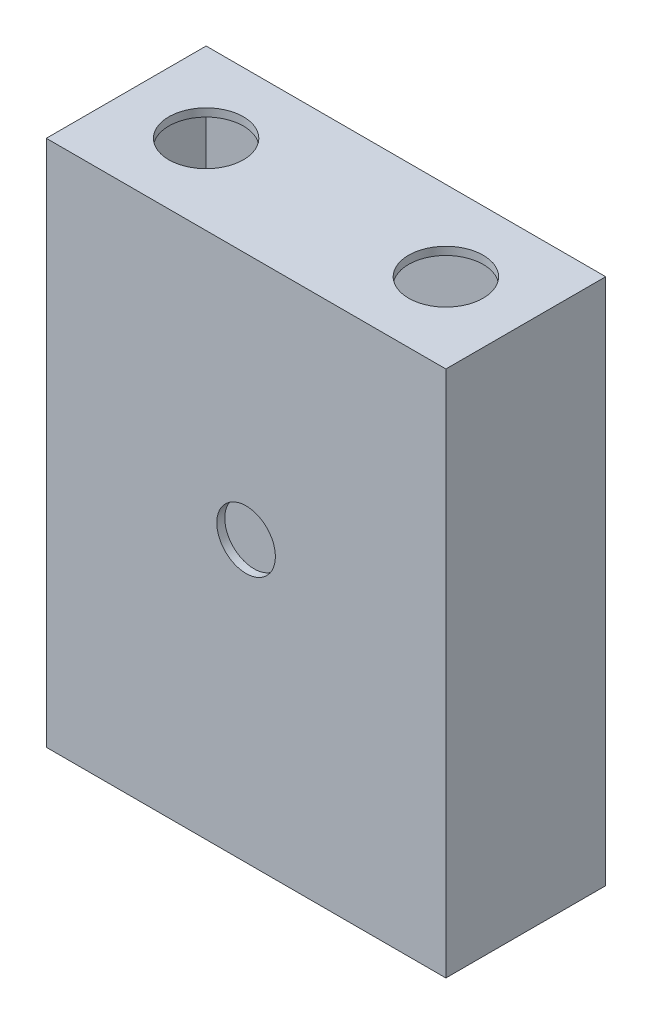
ISO-10303-21;
HEADER;
FILE_DESCRIPTION(('STEP AP214'),'2;1');
FILE_NAME('part.step','',(''),(''),'','','');
FILE_SCHEMA(('AUTOMOTIVE_DESIGN { 1 0 10303 214 1 1 1 1 }'));
ENDSEC;
DATA;
#1=APPLICATION_CONTEXT('core data for automotive mechanical design processes');
#2=APPLICATION_PROTOCOL_DEFINITION('international standard','automotive_design',2000,#1);
#3=PRODUCT_CONTEXT('',#1,'mechanical');
#4=PRODUCT('Part','Part','',(#3));
#5=PRODUCT_RELATED_PRODUCT_CATEGORY('part','',(#4));
#6=PRODUCT_DEFINITION_FORMATION('','',#4);
#7=PRODUCT_DEFINITION_CONTEXT('part definition',#1,'design');
#8=PRODUCT_DEFINITION('design','',#6,#7);
#9=PRODUCT_DEFINITION_SHAPE('','',#8);
#10=(LENGTH_UNIT() NAMED_UNIT(*) SI_UNIT(.MILLI.,.METRE.));
#11=(NAMED_UNIT(*) PLANE_ANGLE_UNIT() SI_UNIT($,.RADIAN.));
#12=(NAMED_UNIT(*) SI_UNIT($,.STERADIAN.) SOLID_ANGLE_UNIT());
#13=UNCERTAINTY_MEASURE_WITH_UNIT(LENGTH_MEASURE(1.E-05),#10,'distance_accuracy_value','');
#14=(GEOMETRIC_REPRESENTATION_CONTEXT(3) GLOBAL_UNCERTAINTY_ASSIGNED_CONTEXT((#13)) GLOBAL_UNIT_ASSIGNED_CONTEXT((#10,
#11,#12)) REPRESENTATION_CONTEXT('',''));
#15=CARTESIAN_POINT('',(0.,0.,0.));
#16=DIRECTION('',(0.,0.,1.));
#17=DIRECTION('',(1.,0.,0.));
#18=AXIS2_PLACEMENT_3D('',#15,#16,#17);
#19=CARTESIAN_POINT('',(0.,3.,0.));
#20=DIRECTION('',(0.,-1.,0.));
#21=DIRECTION('',(0.,0.,-1.));
#22=AXIS2_PLACEMENT_3D('',#19,#20,#21);
#23=PLANE('',#22);
#24=DIRECTION('',(1.,0.,0.));
#25=VECTOR('',#24,1.);
#26=CARTESIAN_POINT('',(-120.,3.,30.));
#27=LINE('',#26,#25);
#28=CARTESIAN_POINT('',(-120.,3.,30.));
#29=VERTEX_POINT('',#28);
#30=CARTESIAN_POINT('',(30.,3.,30.));
#31=VERTEX_POINT('',#30);
#32=EDGE_CURVE('E167',#29,#31,#27,.T.);
#33=ORIENTED_EDGE('',*,*,#32,.T.);
#34=DIRECTION('',(0.,0.,1.));
#35=VECTOR('',#34,1.);
#36=CARTESIAN_POINT('',(30.,3.,-30.));
#37=LINE('',#36,#35);
#38=CARTESIAN_POINT('',(30.,3.,-30.));
#39=VERTEX_POINT('',#38);
#40=EDGE_CURVE('E147',#39,#31,#37,.T.);
#41=ORIENTED_EDGE('',*,*,#40,.F.);
#42=DIRECTION('',(-1.,0.,0.));
#43=VECTOR('',#42,1.);
#44=CARTESIAN_POINT('',(-120.,3.,-30.));
#45=LINE('',#44,#43);
#46=CARTESIAN_POINT('',(-120.,3.,-30.));
#47=VERTEX_POINT('',#46);
#48=EDGE_CURVE('E161',#39,#47,#45,.T.);
#49=ORIENTED_EDGE('',*,*,#48,.T.);
#50=DIRECTION('',(0.,0.,1.));
#51=VECTOR('',#50,1.);
#52=CARTESIAN_POINT('',(-120.,3.,30.));
#53=LINE('',#52,#51);
#54=EDGE_CURVE('E165',#47,#29,#53,.T.);
#55=ORIENTED_EDGE('',*,*,#54,.T.);
#56=EDGE_LOOP('',(#33,#41,#49,#55));
#57=FACE_BOUND('',#56,.T.);
#58=CARTESIAN_POINT('',(0.,3.,0.));
#59=DIRECTION('',(0.,1.,0.));
#60=DIRECTION('',(0.,0.,1.));
#61=AXIS2_PLACEMENT_3D('',#58,#59,#60);
#62=CIRCLE('',#61,14.);
#63=CARTESIAN_POINT('',(0.,3.,14.));
#64=VERTEX_POINT('',#63);
#65=EDGE_CURVE('E158',#64,#64,#62,.T.);
#66=ORIENTED_EDGE('',*,*,#65,.F.);
#67=EDGE_LOOP('',(#66));
#68=FACE_BOUND('',#67,.T.);
#69=CARTESIAN_POINT('',(-90.,3.,0.));
#70=DIRECTION('',(0.,1.,0.));
#71=DIRECTION('',(0.,0.,1.));
#72=AXIS2_PLACEMENT_3D('',#69,#70,#71);
#73=CIRCLE('',#72,14.);
#74=CARTESIAN_POINT('',(-90.,3.,14.));
#75=VERTEX_POINT('',#74);
#76=EDGE_CURVE('E152',#75,#75,#73,.T.);
#77=ORIENTED_EDGE('',*,*,#76,.F.);
#78=EDGE_LOOP('',(#77));
#79=FACE_BOUND('',#78,.T.);
#80=ADVANCED_FACE('F33',(#57,#68,#79),#23,.F.);
#81=CARTESIAN_POINT('',(0.,0.,0.));
#82=DIRECTION('',(0.,-1.,0.));
#83=DIRECTION('',(0.,0.,-1.));
#84=AXIS2_PLACEMENT_3D('',#81,#82,#83);
#85=PLANE('',#84);
#86=DIRECTION('',(1.,0.,0.));
#87=VECTOR('',#86,1.);
#88=CARTESIAN_POINT('',(-117.,0.,-27.));
#89=LINE('',#88,#87);
#90=CARTESIAN_POINT('',(-117.,0.,-27.));
#91=VERTEX_POINT('',#90);
#92=CARTESIAN_POINT('',(27.,0.,-27.));
#93=VERTEX_POINT('',#92);
#94=EDGE_CURVE('E49',#91,#93,#89,.T.);
#95=ORIENTED_EDGE('',*,*,#94,.T.);
#96=DIRECTION('',(0.,0.,1.));
#97=VECTOR('',#96,1.);
#98=CARTESIAN_POINT('',(27.,0.,-27.));
#99=LINE('',#98,#97);
#100=CARTESIAN_POINT('',(27.,0.,27.));
#101=VERTEX_POINT('',#100);
#102=EDGE_CURVE('E53',#93,#101,#99,.T.);
#103=ORIENTED_EDGE('',*,*,#102,.T.);
#104=DIRECTION('',(-1.,0.,0.));
#105=VECTOR('',#104,1.);
#106=CARTESIAN_POINT('',(-117.,0.,27.));
#107=LINE('',#106,#105);
#108=CARTESIAN_POINT('',(-117.,0.,27.));
#109=VERTEX_POINT('',#108);
#110=EDGE_CURVE('E128',#101,#109,#107,.T.);
#111=ORIENTED_EDGE('',*,*,#110,.T.);
#112=DIRECTION('',(0.,0.,-1.));
#113=VECTOR('',#112,1.);
#114=CARTESIAN_POINT('',(-117.,0.,-27.));
#115=LINE('',#114,#113);
#116=EDGE_CURVE('E108',#109,#91,#115,.T.);
#117=ORIENTED_EDGE('',*,*,#116,.T.);
#118=EDGE_LOOP('',(#95,#103,#111,#117));
#119=FACE_BOUND('',#118,.T.);
#120=CARTESIAN_POINT('',(0.,0.,0.));
#121=DIRECTION('',(0.,1.,0.));
#122=DIRECTION('',(0.,0.,1.));
#123=AXIS2_PLACEMENT_3D('',#120,#121,#122);
#124=CIRCLE('',#123,14.);
#125=CARTESIAN_POINT('',(0.,0.,14.));
#126=VERTEX_POINT('',#125);
#127=EDGE_CURVE('E155',#126,#126,#124,.T.);
#128=ORIENTED_EDGE('',*,*,#127,.T.);
#129=EDGE_LOOP('',(#128));
#130=FACE_BOUND('',#129,.T.);
#131=CARTESIAN_POINT('',(-90.,0.,0.));
#132=DIRECTION('',(0.,1.,0.));
#133=DIRECTION('',(0.,0.,1.));
#134=AXIS2_PLACEMENT_3D('',#131,#132,#133);
#135=CIRCLE('',#134,14.);
#136=CARTESIAN_POINT('',(-90.,0.,14.));
#137=VERTEX_POINT('',#136);
#138=EDGE_CURVE('E151',#137,#137,#135,.T.);
#139=ORIENTED_EDGE('',*,*,#138,.T.);
#140=EDGE_LOOP('',(#139));
#141=FACE_BOUND('',#140,.T.);
#142=ADVANCED_FACE('F204',(#119,#130,#141),#85,.T.);
#143=CARTESIAN_POINT('',(-120.,3.,-30.));
#144=DIRECTION('',(0.,0.,1.));
#145=DIRECTION('',(1.,0.,0.));
#146=AXIS2_PLACEMENT_3D('',#143,#144,#145);
#147=PLANE('',#146);
#148=ORIENTED_EDGE('',*,*,#48,.F.);
#149=DIRECTION('',(0.,1.,0.));
#150=VECTOR('',#149,1.);
#151=CARTESIAN_POINT('',(30.,-2.,-30.));
#152=LINE('',#151,#150);
#153=CARTESIAN_POINT('',(30.,-195.,-30.));
#154=VERTEX_POINT('',#153);
#155=EDGE_CURVE('E149',#154,#39,#152,.T.);
#156=ORIENTED_EDGE('',*,*,#155,.F.);
#157=DIRECTION('',(1.,0.,0.));
#158=VECTOR('',#157,1.);
#159=CARTESIAN_POINT('',(-120.,-195.,-30.));
#160=LINE('',#159,#158);
#161=CARTESIAN_POINT('',(-120.,-195.,-30.));
#162=VERTEX_POINT('',#161);
#163=EDGE_CURVE('E138',#162,#154,#160,.T.);
#164=ORIENTED_EDGE('',*,*,#163,.F.);
#165=DIRECTION('',(0.,-1.,0.));
#166=VECTOR('',#165,1.);
#167=CARTESIAN_POINT('',(-120.,3.,-30.));
#168=LINE('',#167,#166);
#169=EDGE_CURVE('E42',#47,#162,#168,.T.);
#170=ORIENTED_EDGE('',*,*,#169,.F.);
#171=EDGE_LOOP('',(#148,#156,#164,#170));
#172=FACE_BOUND('',#171,.T.);
#173=ADVANCED_FACE('F35',(#172),#147,.F.);
#174=CARTESIAN_POINT('',(-120.,3.,30.));
#175=DIRECTION('',(1.,0.,0.));
#176=DIRECTION('',(0.,0.,-1.));
#177=AXIS2_PLACEMENT_3D('',#174,#175,#176);
#178=PLANE('',#177);
#179=ORIENTED_EDGE('',*,*,#169,.T.);
#180=DIRECTION('',(0.,0.,-1.));
#181=VECTOR('',#180,1.);
#182=CARTESIAN_POINT('',(-120.,-195.,-30.));
#183=LINE('',#182,#181);
#184=CARTESIAN_POINT('',(-120.,-195.,30.));
#185=VERTEX_POINT('',#184);
#186=EDGE_CURVE('E113',#185,#162,#183,.T.);
#187=ORIENTED_EDGE('',*,*,#186,.F.);
#188=DIRECTION('',(0.,-1.,0.));
#189=VECTOR('',#188,1.);
#190=CARTESIAN_POINT('',(-120.,3.,30.));
#191=LINE('',#190,#189);
#192=EDGE_CURVE('E170',#29,#185,#191,.T.);
#193=ORIENTED_EDGE('',*,*,#192,.F.);
#194=ORIENTED_EDGE('',*,*,#54,.F.);
#195=EDGE_LOOP('',(#179,#187,#193,#194));
#196=FACE_BOUND('',#195,.T.);
#197=ADVANCED_FACE('F177',(#196),#178,.F.);
#198=CARTESIAN_POINT('',(-120.,3.,30.));
#199=DIRECTION('',(0.,0.,-1.));
#200=DIRECTION('',(-1.,0.,0.));
#201=AXIS2_PLACEMENT_3D('',#198,#199,#200);
#202=PLANE('',#201);
#203=CARTESIAN_POINT('',(-45.,-90.,30.));
#204=DIRECTION('',(0.,0.,1.));
#205=DIRECTION('',(1.,0.,0.));
#206=AXIS2_PLACEMENT_3D('',#203,#204,#205);
#207=CIRCLE('',#206,11.);
#208=CARTESIAN_POINT('',(-34.,-90.,30.));
#209=VERTEX_POINT('',#208);
#210=EDGE_CURVE('E340',#209,#209,#207,.T.);
#211=ORIENTED_EDGE('',*,*,#210,.F.);
#212=EDGE_LOOP('',(#211));
#213=FACE_BOUND('',#212,.T.);
#214=ORIENTED_EDGE('',*,*,#192,.T.);
#215=DIRECTION('',(-1.,0.,0.));
#216=VECTOR('',#215,1.);
#217=CARTESIAN_POINT('',(-120.,-195.,30.));
#218=LINE('',#217,#216);
#219=CARTESIAN_POINT('',(30.,-195.,30.));
#220=VERTEX_POINT('',#219);
#221=EDGE_CURVE('E144',#220,#185,#218,.T.);
#222=ORIENTED_EDGE('',*,*,#221,.F.);
#223=DIRECTION('',(0.,1.,0.));
#224=VECTOR('',#223,1.);
#225=CARTESIAN_POINT('',(30.,3.,30.));
#226=LINE('',#225,#224);
#227=EDGE_CURVE('E11',#220,#31,#226,.T.);
#228=ORIENTED_EDGE('',*,*,#227,.T.);
#229=ORIENTED_EDGE('',*,*,#32,.F.);
#230=EDGE_LOOP('',(#214,#222,#228,#229));
#231=FACE_BOUND('',#230,.T.);
#232=ADVANCED_FACE('F185',(#213,#231),#202,.F.);
#233=CARTESIAN_POINT('',(0.,3.,0.));
#234=DIRECTION('',(0.,-1.,0.));
#235=DIRECTION('',(0.,0.,-1.));
#236=AXIS2_PLACEMENT_3D('',#233,#234,#235);
#237=CYLINDRICAL_SURFACE('',#236,14.);
#238=ORIENTED_EDGE('',*,*,#65,.T.);
#239=EDGE_LOOP('',(#238));
#240=FACE_BOUND('',#239,.T.);
#241=ORIENTED_EDGE('',*,*,#127,.F.);
#242=EDGE_LOOP('',(#241));
#243=FACE_BOUND('',#242,.T.);
#244=ADVANCED_FACE('F200',(#240,#243),#237,.F.);
#245=CARTESIAN_POINT('',(-90.,3.,0.));
#246=DIRECTION('',(0.,-1.,0.));
#247=DIRECTION('',(0.,0.,-1.));
#248=AXIS2_PLACEMENT_3D('',#245,#246,#247);
#249=CYLINDRICAL_SURFACE('',#248,14.);
#250=ORIENTED_EDGE('',*,*,#76,.T.);
#251=EDGE_LOOP('',(#250));
#252=FACE_BOUND('',#251,.T.);
#253=ORIENTED_EDGE('',*,*,#138,.F.);
#254=EDGE_LOOP('',(#253));
#255=FACE_BOUND('',#254,.T.);
#256=ADVANCED_FACE('F193',(#252,#255),#249,.F.);
#257=CARTESIAN_POINT('',(30.,-2.,-30.));
#258=DIRECTION('',(-1.,0.,0.));
#259=DIRECTION('',(0.,0.,1.));
#260=AXIS2_PLACEMENT_3D('',#257,#258,#259);
#261=PLANE('',#260);
#262=ORIENTED_EDGE('',*,*,#227,.F.);
#263=DIRECTION('',(0.,0.,1.));
#264=VECTOR('',#263,1.);
#265=CARTESIAN_POINT('',(30.,-195.,-30.));
#266=LINE('',#265,#264);
#267=EDGE_CURVE('E141',#154,#220,#266,.T.);
#268=ORIENTED_EDGE('',*,*,#267,.F.);
#269=ORIENTED_EDGE('',*,*,#155,.T.);
#270=ORIENTED_EDGE('',*,*,#40,.T.);
#271=EDGE_LOOP('',(#262,#268,#269,#270));
#272=FACE_BOUND('',#271,.T.);
#273=ADVANCED_FACE('F191',(#272),#261,.F.);
#274=CARTESIAN_POINT('',(0.,-195.,0.));
#275=DIRECTION('',(0.,1.,0.));
#276=DIRECTION('',(0.,0.,1.));
#277=AXIS2_PLACEMENT_3D('',#274,#275,#276);
#278=PLANE('',#277);
#279=ORIENTED_EDGE('',*,*,#186,.T.);
#280=ORIENTED_EDGE('',*,*,#163,.T.);
#281=ORIENTED_EDGE('',*,*,#267,.T.);
#282=ORIENTED_EDGE('',*,*,#221,.T.);
#283=EDGE_LOOP('',(#279,#280,#281,#282));
#284=FACE_BOUND('',#283,.T.);
#285=DIRECTION('',(1.,0.,0.));
#286=VECTOR('',#285,1.);
#287=CARTESIAN_POINT('',(-117.,-195.,-27.));
#288=LINE('',#287,#286);
#289=CARTESIAN_POINT('',(-117.,-195.,-27.));
#290=VERTEX_POINT('',#289);
#291=CARTESIAN_POINT('',(27.,-195.,-27.));
#292=VERTEX_POINT('',#291);
#293=EDGE_CURVE('E98',#290,#292,#288,.T.);
#294=ORIENTED_EDGE('',*,*,#293,.F.);
#295=DIRECTION('',(0.,0.,-1.));
#296=VECTOR('',#295,1.);
#297=CARTESIAN_POINT('',(-117.,-195.,-27.));
#298=LINE('',#297,#296);
#299=CARTESIAN_POINT('',(-117.,-195.,27.));
#300=VERTEX_POINT('',#299);
#301=EDGE_CURVE('E121',#300,#290,#298,.T.);
#302=ORIENTED_EDGE('',*,*,#301,.F.);
#303=DIRECTION('',(-1.,0.,0.));
#304=VECTOR('',#303,1.);
#305=CARTESIAN_POINT('',(-117.,-195.,27.));
#306=LINE('',#305,#304);
#307=CARTESIAN_POINT('',(27.,-195.,27.));
#308=VERTEX_POINT('',#307);
#309=EDGE_CURVE('E119',#308,#300,#306,.T.);
#310=ORIENTED_EDGE('',*,*,#309,.F.);
#311=DIRECTION('',(0.,0.,1.));
#312=VECTOR('',#311,1.);
#313=CARTESIAN_POINT('',(27.,-195.,-27.));
#314=LINE('',#313,#312);
#315=EDGE_CURVE('E107',#292,#308,#314,.T.);
#316=ORIENTED_EDGE('',*,*,#315,.F.);
#317=EDGE_LOOP('',(#294,#302,#310,#316));
#318=FACE_BOUND('',#317,.T.);
#319=ADVANCED_FACE('F117',(#284,#318),#278,.F.);
#320=CARTESIAN_POINT('',(-117.,-195.,-27.));
#321=DIRECTION('',(0.,0.,1.));
#322=DIRECTION('',(1.,0.,0.));
#323=AXIS2_PLACEMENT_3D('',#320,#321,#322);
#324=PLANE('',#323);
#325=ORIENTED_EDGE('',*,*,#94,.F.);
#326=DIRECTION('',(0.,1.,0.));
#327=VECTOR('',#326,1.);
#328=CARTESIAN_POINT('',(-117.,-195.,-27.));
#329=LINE('',#328,#327);
#330=EDGE_CURVE('E103',#290,#91,#329,.T.);
#331=ORIENTED_EDGE('',*,*,#330,.F.);
#332=ORIENTED_EDGE('',*,*,#293,.T.);
#333=DIRECTION('',(0.,1.,0.));
#334=VECTOR('',#333,1.);
#335=CARTESIAN_POINT('',(27.,-195.,-27.));
#336=LINE('',#335,#334);
#337=EDGE_CURVE('E101',#292,#93,#336,.T.);
#338=ORIENTED_EDGE('',*,*,#337,.T.);
#339=EDGE_LOOP('',(#325,#331,#332,#338));
#340=FACE_BOUND('',#339,.T.);
#341=ADVANCED_FACE('F100',(#340),#324,.T.);
#342=CARTESIAN_POINT('',(27.,-195.,-27.));
#343=DIRECTION('',(-1.,0.,0.));
#344=DIRECTION('',(0.,0.,1.));
#345=AXIS2_PLACEMENT_3D('',#342,#343,#344);
#346=PLANE('',#345);
#347=ORIENTED_EDGE('',*,*,#102,.F.);
#348=ORIENTED_EDGE('',*,*,#337,.F.);
#349=ORIENTED_EDGE('',*,*,#315,.T.);
#350=DIRECTION('',(0.,1.,0.));
#351=VECTOR('',#350,1.);
#352=CARTESIAN_POINT('',(27.,-195.,27.));
#353=LINE('',#352,#351);
#354=EDGE_CURVE('E114',#308,#101,#353,.T.);
#355=ORIENTED_EDGE('',*,*,#354,.T.);
#356=EDGE_LOOP('',(#347,#348,#349,#355));
#357=FACE_BOUND('',#356,.T.);
#358=ADVANCED_FACE('F111',(#357),#346,.T.);
#359=CARTESIAN_POINT('',(-117.,-195.,27.));
#360=DIRECTION('',(0.,0.,-1.));
#361=DIRECTION('',(-1.,0.,0.));
#362=AXIS2_PLACEMENT_3D('',#359,#360,#361);
#363=PLANE('',#362);
#364=CARTESIAN_POINT('',(-45.,-90.,27.));
#365=DIRECTION('',(0.,0.,-1.));
#366=DIRECTION('',(-1.,0.,0.));
#367=AXIS2_PLACEMENT_3D('',#364,#365,#366);
#368=CIRCLE('',#367,11.);
#369=CARTESIAN_POINT('',(-56.,-90.,27.));
#370=VERTEX_POINT('',#369);
#371=EDGE_CURVE('E37',#370,#370,#368,.T.);
#372=ORIENTED_EDGE('',*,*,#371,.F.);
#373=EDGE_LOOP('',(#372));
#374=FACE_BOUND('',#373,.T.);
#375=ORIENTED_EDGE('',*,*,#110,.F.);
#376=ORIENTED_EDGE('',*,*,#354,.F.);
#377=ORIENTED_EDGE('',*,*,#309,.T.);
#378=DIRECTION('',(0.,1.,0.));
#379=VECTOR('',#378,1.);
#380=CARTESIAN_POINT('',(-117.,-195.,27.));
#381=LINE('',#380,#379);
#382=EDGE_CURVE('E132',#300,#109,#381,.T.);
#383=ORIENTED_EDGE('',*,*,#382,.T.);
#384=EDGE_LOOP('',(#375,#376,#377,#383));
#385=FACE_BOUND('',#384,.T.);
#386=ADVANCED_FACE('F264',(#374,#385),#363,.T.);
#387=CARTESIAN_POINT('',(-117.,-195.,-27.));
#388=DIRECTION('',(1.,0.,0.));
#389=DIRECTION('',(0.,0.,-1.));
#390=AXIS2_PLACEMENT_3D('',#387,#388,#389);
#391=PLANE('',#390);
#392=ORIENTED_EDGE('',*,*,#116,.F.);
#393=ORIENTED_EDGE('',*,*,#382,.F.);
#394=ORIENTED_EDGE('',*,*,#301,.T.);
#395=ORIENTED_EDGE('',*,*,#330,.T.);
#396=EDGE_LOOP('',(#392,#393,#394,#395));
#397=FACE_BOUND('',#396,.T.);
#398=ADVANCED_FACE('F259',(#397),#391,.T.);
#399=CARTESIAN_POINT('',(-45.,-90.,25.));
#400=DIRECTION('',(0.,0.,1.));
#401=DIRECTION('',(1.,0.,0.));
#402=AXIS2_PLACEMENT_3D('',#399,#400,#401);
#403=CYLINDRICAL_SURFACE('',#402,11.);
#404=ORIENTED_EDGE('',*,*,#371,.T.);
#405=EDGE_LOOP('',(#404));
#406=FACE_BOUND('',#405,.T.);
#407=ORIENTED_EDGE('',*,*,#210,.T.);
#408=EDGE_LOOP('',(#407));
#409=FACE_BOUND('',#408,.T.);
#410=ADVANCED_FACE('F276',(#406,#409),#403,.F.);
#411=CLOSED_SHELL('',(#80,#142,#173,#197,#232,#244,#256,#273,#319,#341,#358,#386,#398,#410));
#412=MANIFOLD_SOLID_BREP('B2',#411);
#413=ADVANCED_BREP_SHAPE_REPRESENTATION('',(#18,#412),#14);
#414=SHAPE_DEFINITION_REPRESENTATION(#9,#413);
ENDSEC;
END-ISO-10303-21;
